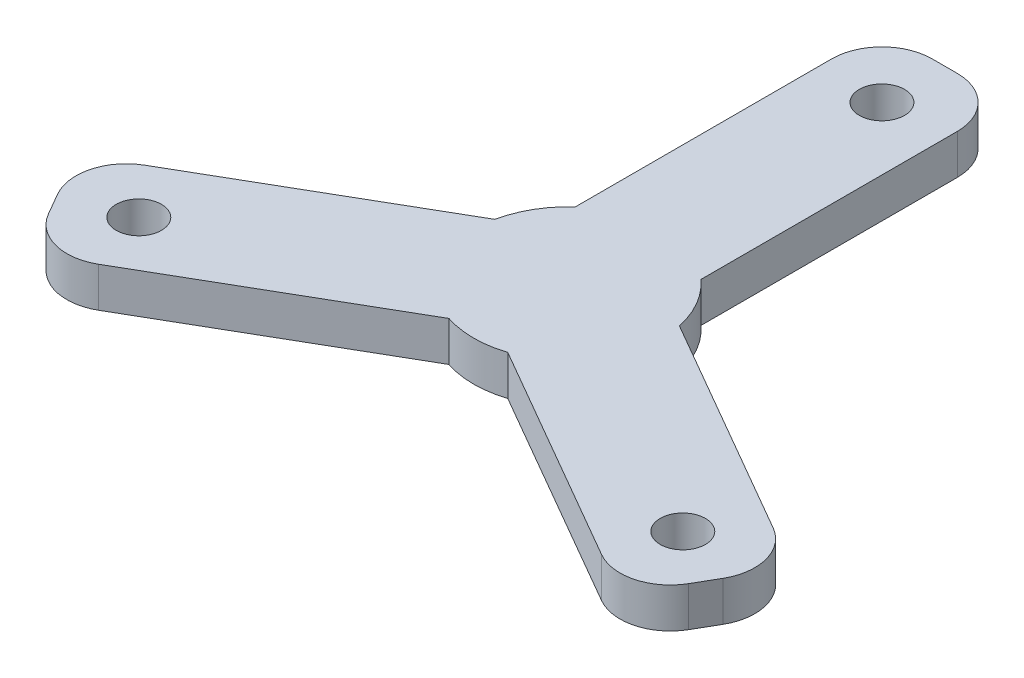
ISO-10303-21;
HEADER;
FILE_DESCRIPTION(('STEP AP214'),'2;1');
FILE_NAME('part.step','',(''),(''),'','','');
FILE_SCHEMA(('AUTOMOTIVE_DESIGN { 1 0 10303 214 1 1 1 1 }'));
ENDSEC;
DATA;
#1=APPLICATION_CONTEXT('core data for automotive mechanical design processes');
#2=APPLICATION_PROTOCOL_DEFINITION('international standard','automotive_design',2000,#1);
#3=PRODUCT_CONTEXT('',#1,'mechanical');
#4=PRODUCT('Part','Part','',(#3));
#5=PRODUCT_RELATED_PRODUCT_CATEGORY('part','',(#4));
#6=PRODUCT_DEFINITION_FORMATION('','',#4);
#7=PRODUCT_DEFINITION_CONTEXT('part definition',#1,'design');
#8=PRODUCT_DEFINITION('design','',#6,#7);
#9=PRODUCT_DEFINITION_SHAPE('','',#8);
#10=(LENGTH_UNIT() NAMED_UNIT(*) SI_UNIT(.MILLI.,.METRE.));
#11=(NAMED_UNIT(*) PLANE_ANGLE_UNIT() SI_UNIT($,.RADIAN.));
#12=(NAMED_UNIT(*) SI_UNIT($,.STERADIAN.) SOLID_ANGLE_UNIT());
#13=UNCERTAINTY_MEASURE_WITH_UNIT(LENGTH_MEASURE(1.E-05),#10,'distance_accuracy_value','');
#14=(GEOMETRIC_REPRESENTATION_CONTEXT(3) GLOBAL_UNCERTAINTY_ASSIGNED_CONTEXT((#13)) GLOBAL_UNIT_ASSIGNED_CONTEXT((#10,
#11,#12)) REPRESENTATION_CONTEXT('',''));
#15=CARTESIAN_POINT('',(0.,0.,0.));
#16=DIRECTION('',(0.,0.,1.));
#17=DIRECTION('',(1.,0.,0.));
#18=AXIS2_PLACEMENT_3D('',#15,#16,#17);
#19=CARTESIAN_POINT('',(0.,3.175,0.));
#20=DIRECTION('',(0.,-1.,0.));
#21=DIRECTION('',(0.,0.,-1.));
#22=AXIS2_PLACEMENT_3D('',#19,#20,#21);
#23=CYLINDRICAL_SURFACE('',#22,7.5);
#24=CARTESIAN_POINT('',(0.,0.,0.));
#25=DIRECTION('',(0.,1.,0.));
#26=DIRECTION('',(0.,0.,1.));
#27=AXIS2_PLACEMENT_3D('',#24,#25,#26);
#28=CIRCLE('',#27,7.5);
#29=CARTESIAN_POINT('',(-5.,0.,-5.59016994374947));
#30=VERTEX_POINT('',#29);
#31=CARTESIAN_POINT('',(-7.34122918275927,0.,-1.53504204704745));
#32=VERTEX_POINT('',#31);
#33=EDGE_CURVE('E219',#30,#32,#28,.T.);
#34=ORIENTED_EDGE('',*,*,#33,.T.);
#35=DIRECTION('',(0.,-1.,0.));
#36=VECTOR('',#35,1.);
#37=CARTESIAN_POINT('',(-7.34122918275927,3.175,-1.53504204704745));
#38=LINE('',#37,#36);
#39=CARTESIAN_POINT('',(-7.34122918275927,3.175,-1.53504204704745));
#40=VERTEX_POINT('',#39);
#41=EDGE_CURVE('E11',#40,#32,#38,.T.);
#42=ORIENTED_EDGE('',*,*,#41,.F.);
#43=CARTESIAN_POINT('',(0.,3.175,0.));
#44=DIRECTION('',(0.,1.,0.));
#45=DIRECTION('',(0.,0.,1.));
#46=AXIS2_PLACEMENT_3D('',#43,#44,#45);
#47=CIRCLE('',#46,7.5);
#48=CARTESIAN_POINT('',(-5.,3.175,-5.59016994374947));
#49=VERTEX_POINT('',#48);
#50=EDGE_CURVE('E297',#49,#40,#47,.T.);
#51=ORIENTED_EDGE('',*,*,#50,.F.);
#52=DIRECTION('',(0.,-1.,0.));
#53=VECTOR('',#52,1.);
#54=CARTESIAN_POINT('',(-5.,3.175,-5.59016994374947));
#55=LINE('',#54,#53);
#56=EDGE_CURVE('E62',#49,#30,#55,.T.);
#57=ORIENTED_EDGE('',*,*,#56,.T.);
#58=EDGE_LOOP('',(#34,#42,#51,#57));
#59=FACE_BOUND('',#58,.T.);
#60=ADVANCED_FACE('F45',(#59),#23,.T.);
#61=CARTESIAN_POINT('',(-2.5,3.175,-4.33012701892219));
#62=DIRECTION('',(0.5,0.,0.866025403784438));
#63=DIRECTION('',(0.866025403784438,0.,-0.5));
#64=AXIS2_PLACEMENT_3D('',#61,#62,#63);
#65=PLANE('',#64);
#66=DIRECTION('',(-0.866025403784438,0.,0.5));
#67=VECTOR('',#66,1.);
#68=CARTESIAN_POINT('',(-2.5,0.,-4.33012701892219));
#69=LINE('',#68,#67);
#70=CARTESIAN_POINT('',(-25.0166604983954,0.,8.66987298107781));
#71=VERTEX_POINT('',#70);
#72=EDGE_CURVE('E222',#32,#71,#69,.T.);
#73=ORIENTED_EDGE('',*,*,#72,.T.);
#74=DIRECTION('',(0.,-1.,0.));
#75=VECTOR('',#74,1.);
#76=CARTESIAN_POINT('',(-25.0166604983954,3.175,8.66987298107781));
#77=LINE('',#76,#75);
#78=CARTESIAN_POINT('',(-25.0166604983954,3.175,8.66987298107781));
#79=VERTEX_POINT('',#78);
#80=EDGE_CURVE('E54',#79,#71,#77,.T.);
#81=ORIENTED_EDGE('',*,*,#80,.F.);
#82=DIRECTION('',(-0.866025403784438,0.,0.5));
#83=VECTOR('',#82,1.);
#84=CARTESIAN_POINT('',(-2.5,3.175,-4.33012701892219));
#85=LINE('',#84,#83);
#86=EDGE_CURVE('E130',#40,#79,#85,.T.);
#87=ORIENTED_EDGE('',*,*,#86,.F.);
#88=ORIENTED_EDGE('',*,*,#41,.T.);
#89=EDGE_LOOP('',(#73,#81,#87,#88));
#90=FACE_BOUND('',#89,.T.);
#91=ADVANCED_FACE('F348',(#90),#65,.F.);
#92=CARTESIAN_POINT('',(-23.0166604983954,3.175,12.1339745962156));
#93=DIRECTION('',(0.,-1.,0.));
#94=DIRECTION('',(0.,0.,-1.));
#95=AXIS2_PLACEMENT_3D('',#92,#93,#94);
#96=CYLINDRICAL_SURFACE('',#95,4.);
#97=CARTESIAN_POINT('',(-23.0166604983954,0.,12.1339745962156));
#98=DIRECTION('',(0.,1.,0.));
#99=DIRECTION('',(0.,0.,1.));
#100=AXIS2_PLACEMENT_3D('',#97,#98,#99);
#101=CIRCLE('',#100,4.);
#102=CARTESIAN_POINT('',(-26.4807621135331,0.,14.1339745962156));
#103=VERTEX_POINT('',#102);
#104=EDGE_CURVE('E226',#103,#71,#101,.F.);
#105=ORIENTED_EDGE('',*,*,#104,.F.);
#106=DIRECTION('',(0.,-1.,0.));
#107=VECTOR('',#106,1.);
#108=CARTESIAN_POINT('',(-26.4807621135331,3.175,14.1339745962156));
#109=LINE('',#108,#107);
#110=CARTESIAN_POINT('',(-26.4807621135331,3.175,14.1339745962156));
#111=VERTEX_POINT('',#110);
#112=EDGE_CURVE('E339',#111,#103,#109,.T.);
#113=ORIENTED_EDGE('',*,*,#112,.F.);
#114=CARTESIAN_POINT('',(-23.0166604983954,3.175,12.1339745962156));
#115=DIRECTION('',(0.,1.,0.));
#116=DIRECTION('',(0.,0.,1.));
#117=AXIS2_PLACEMENT_3D('',#114,#115,#116);
#118=CIRCLE('',#117,4.);
#119=EDGE_CURVE('E347',#111,#79,#118,.F.);
#120=ORIENTED_EDGE('',*,*,#119,.T.);
#121=ORIENTED_EDGE('',*,*,#80,.T.);
#122=EDGE_LOOP('',(#105,#113,#120,#121));
#123=FACE_BOUND('',#122,.T.);
#124=ADVANCED_FACE('F345',(#123),#96,.T.);
#125=CARTESIAN_POINT('',(-25.9807621135332,3.175,15.));
#126=DIRECTION('',(-0.866025403784439,0.,0.5));
#127=DIRECTION('',(0.5,0.,0.866025403784439));
#128=AXIS2_PLACEMENT_3D('',#125,#126,#127);
#129=PLANE('',#128);
#130=DIRECTION('',(-0.5,0.,-0.866025403784439));
#131=VECTOR('',#130,1.);
#132=CARTESIAN_POINT('',(-25.9807621135332,0.,15.));
#133=LINE('',#132,#131);
#134=CARTESIAN_POINT('',(-25.4807621135331,0.,15.8660254037845));
#135=VERTEX_POINT('',#134);
#136=EDGE_CURVE('E230',#135,#103,#133,.T.);
#137=ORIENTED_EDGE('',*,*,#136,.F.);
#138=DIRECTION('',(0.,-1.,0.));
#139=VECTOR('',#138,1.);
#140=CARTESIAN_POINT('',(-25.4807621135331,3.175,15.8660254037845));
#141=LINE('',#140,#139);
#142=CARTESIAN_POINT('',(-25.4807621135331,3.175,15.8660254037845));
#143=VERTEX_POINT('',#142);
#144=EDGE_CURVE('E336',#143,#135,#141,.T.);
#145=ORIENTED_EDGE('',*,*,#144,.F.);
#146=DIRECTION('',(-0.5,0.,-0.866025403784439));
#147=VECTOR('',#146,1.);
#148=CARTESIAN_POINT('',(-25.9807621135332,3.175,15.));
#149=LINE('',#148,#147);
#150=EDGE_CURVE('E359',#143,#111,#149,.T.);
#151=ORIENTED_EDGE('',*,*,#150,.T.);
#152=ORIENTED_EDGE('',*,*,#112,.T.);
#153=EDGE_LOOP('',(#137,#145,#151,#152));
#154=FACE_BOUND('',#153,.T.);
#155=ADVANCED_FACE('F356',(#154),#129,.T.);
#156=CARTESIAN_POINT('',(-22.0166604983954,3.175,13.8660254037844));
#157=DIRECTION('',(0.,-1.,0.));
#158=DIRECTION('',(0.,0.,-1.));
#159=AXIS2_PLACEMENT_3D('',#156,#157,#158);
#160=CYLINDRICAL_SURFACE('',#159,4.);
#161=CARTESIAN_POINT('',(-22.0166604983954,0.,13.8660254037844));
#162=DIRECTION('',(0.,1.,0.));
#163=DIRECTION('',(0.,0.,1.));
#164=AXIS2_PLACEMENT_3D('',#161,#162,#163);
#165=CIRCLE('',#164,4.);
#166=CARTESIAN_POINT('',(-20.0166604983954,0.,17.3301270189222));
#167=VERTEX_POINT('',#166);
#168=EDGE_CURVE('E234',#167,#135,#165,.F.);
#169=ORIENTED_EDGE('',*,*,#168,.F.);
#170=DIRECTION('',(0.,-1.,0.));
#171=VECTOR('',#170,1.);
#172=CARTESIAN_POINT('',(-20.0166604983954,3.175,17.3301270189222));
#173=LINE('',#172,#171);
#174=CARTESIAN_POINT('',(-20.0166604983954,3.175,17.3301270189222));
#175=VERTEX_POINT('',#174);
#176=EDGE_CURVE('E333',#175,#167,#173,.T.);
#177=ORIENTED_EDGE('',*,*,#176,.F.);
#178=CARTESIAN_POINT('',(-22.0166604983954,3.175,13.8660254037844));
#179=DIRECTION('',(0.,1.,0.));
#180=DIRECTION('',(0.,0.,1.));
#181=AXIS2_PLACEMENT_3D('',#178,#179,#180);
#182=CIRCLE('',#181,4.);
#183=EDGE_CURVE('E366',#175,#143,#182,.F.);
#184=ORIENTED_EDGE('',*,*,#183,.T.);
#185=ORIENTED_EDGE('',*,*,#144,.T.);
#186=EDGE_LOOP('',(#169,#177,#184,#185));
#187=FACE_BOUND('',#186,.T.);
#188=ADVANCED_FACE('F437',(#187),#160,.T.);
#189=CARTESIAN_POINT('',(2.5,3.175,4.33012701892219));
#190=DIRECTION('',(0.5,0.,0.866025403784438));
#191=DIRECTION('',(0.866025403784438,0.,-0.500000000000001));
#192=AXIS2_PLACEMENT_3D('',#189,#190,#191);
#193=PLANE('',#192);
#194=DIRECTION('',(-0.866025403784438,0.,0.5));
#195=VECTOR('',#194,1.);
#196=CARTESIAN_POINT('',(2.5,0.,4.33012701892219));
#197=LINE('',#196,#195);
#198=CARTESIAN_POINT('',(-2.34122918275927,0.,7.12521199079693));
#199=VERTEX_POINT('',#198);
#200=EDGE_CURVE('E238',#199,#167,#197,.T.);
#201=ORIENTED_EDGE('',*,*,#200,.F.);
#202=DIRECTION('',(0.,-1.,0.));
#203=VECTOR('',#202,1.);
#204=CARTESIAN_POINT('',(-2.34122918275927,3.175,7.12521199079693));
#205=LINE('',#204,#203);
#206=CARTESIAN_POINT('',(-2.34122918275927,3.175,7.12521199079693));
#207=VERTEX_POINT('',#206);
#208=EDGE_CURVE('E330',#207,#199,#205,.T.);
#209=ORIENTED_EDGE('',*,*,#208,.F.);
#210=DIRECTION('',(-0.866025403784438,0.,0.5));
#211=VECTOR('',#210,1.);
#212=CARTESIAN_POINT('',(2.5,3.175,4.33012701892219));
#213=LINE('',#212,#211);
#214=EDGE_CURVE('E373',#207,#175,#213,.T.);
#215=ORIENTED_EDGE('',*,*,#214,.T.);
#216=ORIENTED_EDGE('',*,*,#176,.T.);
#217=EDGE_LOOP('',(#201,#209,#215,#216));
#218=FACE_BOUND('',#217,.T.);
#219=ADVANCED_FACE('F440',(#218),#193,.T.);
#220=CARTESIAN_POINT('',(0.,3.175,0.));
#221=DIRECTION('',(0.,-1.,0.));
#222=DIRECTION('',(0.,0.,-1.));
#223=AXIS2_PLACEMENT_3D('',#220,#221,#222);
#224=CYLINDRICAL_SURFACE('',#223,7.5);
#225=CARTESIAN_POINT('',(0.,0.,0.));
#226=DIRECTION('',(0.,1.,0.));
#227=DIRECTION('',(0.,0.,1.));
#228=AXIS2_PLACEMENT_3D('',#225,#226,#227);
#229=CIRCLE('',#228,7.5);
#230=CARTESIAN_POINT('',(2.34122918275927,0.,7.12521199079693));
#231=VERTEX_POINT('',#230);
#232=EDGE_CURVE('E242',#199,#231,#229,.T.);
#233=ORIENTED_EDGE('',*,*,#232,.T.);
#234=DIRECTION('',(0.,-1.,0.));
#235=VECTOR('',#234,1.);
#236=CARTESIAN_POINT('',(2.34122918275927,3.175,7.12521199079693));
#237=LINE('',#236,#235);
#238=CARTESIAN_POINT('',(2.34122918275927,3.175,7.12521199079693));
#239=VERTEX_POINT('',#238);
#240=EDGE_CURVE('E326',#239,#231,#237,.T.);
#241=ORIENTED_EDGE('',*,*,#240,.F.);
#242=CARTESIAN_POINT('',(0.,3.175,0.));
#243=DIRECTION('',(0.,1.,0.));
#244=DIRECTION('',(0.,0.,1.));
#245=AXIS2_PLACEMENT_3D('',#242,#243,#244);
#246=CIRCLE('',#245,7.5);
#247=EDGE_CURVE('E377',#207,#239,#246,.T.);
#248=ORIENTED_EDGE('',*,*,#247,.F.);
#249=ORIENTED_EDGE('',*,*,#208,.T.);
#250=EDGE_LOOP('',(#233,#241,#248,#249));
#251=FACE_BOUND('',#250,.T.);
#252=ADVANCED_FACE('F444',(#251),#224,.T.);
#253=CARTESIAN_POINT('',(-2.5,3.175,4.3301270189222));
#254=DIRECTION('',(0.5,0.,-0.866025403784439));
#255=DIRECTION('',(-0.866025403784439,0.,-0.5));
#256=AXIS2_PLACEMENT_3D('',#253,#254,#255);
#257=PLANE('',#256);
#258=DIRECTION('',(0.866025403784439,0.,0.5));
#259=VECTOR('',#258,1.);
#260=CARTESIAN_POINT('',(-2.5,0.,4.3301270189222));
#261=LINE('',#260,#259);
#262=CARTESIAN_POINT('',(20.0166604983954,0.,17.3301270189222));
#263=VERTEX_POINT('',#262);
#264=EDGE_CURVE('E245',#231,#263,#261,.T.);
#265=ORIENTED_EDGE('',*,*,#264,.T.);
#266=DIRECTION('',(0.,-1.,0.));
#267=VECTOR('',#266,1.);
#268=CARTESIAN_POINT('',(20.0166604983954,3.175,17.3301270189222));
#269=LINE('',#268,#267);
#270=CARTESIAN_POINT('',(20.0166604983954,3.175,17.3301270189222));
#271=VERTEX_POINT('',#270);
#272=EDGE_CURVE('E323',#271,#263,#269,.T.);
#273=ORIENTED_EDGE('',*,*,#272,.F.);
#274=DIRECTION('',(0.866025403784439,0.,0.5));
#275=VECTOR('',#274,1.);
#276=CARTESIAN_POINT('',(-2.5,3.175,4.3301270189222));
#277=LINE('',#276,#275);
#278=EDGE_CURVE('E380',#239,#271,#277,.T.);
#279=ORIENTED_EDGE('',*,*,#278,.F.);
#280=ORIENTED_EDGE('',*,*,#240,.T.);
#281=EDGE_LOOP('',(#265,#273,#279,#280));
#282=FACE_BOUND('',#281,.T.);
#283=ADVANCED_FACE('F448',(#282),#257,.F.);
#284=CARTESIAN_POINT('',(22.0166604983954,3.175,13.8660254037844));
#285=DIRECTION('',(0.,-1.,0.));
#286=DIRECTION('',(0.,0.,-1.));
#287=AXIS2_PLACEMENT_3D('',#284,#285,#286);
#288=CYLINDRICAL_SURFACE('',#287,4.);
#289=CARTESIAN_POINT('',(22.0166604983954,0.,13.8660254037844));
#290=DIRECTION('',(0.,1.,0.));
#291=DIRECTION('',(0.,0.,1.));
#292=AXIS2_PLACEMENT_3D('',#289,#290,#291);
#293=CIRCLE('',#292,4.);
#294=CARTESIAN_POINT('',(25.4807621135332,0.,15.8660254037844));
#295=VERTEX_POINT('',#294);
#296=EDGE_CURVE('E249',#295,#263,#293,.F.);
#297=ORIENTED_EDGE('',*,*,#296,.F.);
#298=DIRECTION('',(0.,-1.,0.));
#299=VECTOR('',#298,1.);
#300=CARTESIAN_POINT('',(25.4807621135332,3.175,15.8660254037844));
#301=LINE('',#300,#299);
#302=CARTESIAN_POINT('',(25.4807621135332,3.175,15.8660254037844));
#303=VERTEX_POINT('',#302);
#304=EDGE_CURVE('E320',#303,#295,#301,.T.);
#305=ORIENTED_EDGE('',*,*,#304,.F.);
#306=CARTESIAN_POINT('',(22.0166604983954,3.175,13.8660254037844));
#307=DIRECTION('',(0.,1.,0.));
#308=DIRECTION('',(0.,0.,1.));
#309=AXIS2_PLACEMENT_3D('',#306,#307,#308);
#310=CIRCLE('',#309,4.);
#311=EDGE_CURVE('E383',#303,#271,#310,.F.);
#312=ORIENTED_EDGE('',*,*,#311,.T.);
#313=ORIENTED_EDGE('',*,*,#272,.T.);
#314=EDGE_LOOP('',(#297,#305,#312,#313));
#315=FACE_BOUND('',#314,.T.);
#316=ADVANCED_FACE('F452',(#315),#288,.T.);
#317=CARTESIAN_POINT('',(25.9807621135331,3.175,15.));
#318=DIRECTION('',(0.866025403784438,0.,0.500000000000001));
#319=DIRECTION('',(0.500000000000001,0.,-0.866025403784438));
#320=AXIS2_PLACEMENT_3D('',#317,#318,#319);
#321=PLANE('',#320);
#322=DIRECTION('',(-0.500000000000001,0.,0.866025403784438));
#323=VECTOR('',#322,1.);
#324=CARTESIAN_POINT('',(25.9807621135331,0.,15.));
#325=LINE('',#324,#323);
#326=CARTESIAN_POINT('',(26.4807621135332,0.,14.1339745962156));
#327=VERTEX_POINT('',#326);
#328=EDGE_CURVE('E253',#327,#295,#325,.T.);
#329=ORIENTED_EDGE('',*,*,#328,.F.);
#330=DIRECTION('',(0.,-1.,0.));
#331=VECTOR('',#330,1.);
#332=CARTESIAN_POINT('',(26.4807621135332,3.175,14.1339745962156));
#333=LINE('',#332,#331);
#334=CARTESIAN_POINT('',(26.4807621135332,3.175,14.1339745962156));
#335=VERTEX_POINT('',#334);
#336=EDGE_CURVE('E317',#335,#327,#333,.T.);
#337=ORIENTED_EDGE('',*,*,#336,.F.);
#338=DIRECTION('',(-0.500000000000001,0.,0.866025403784438));
#339=VECTOR('',#338,1.);
#340=CARTESIAN_POINT('',(25.9807621135331,3.175,15.));
#341=LINE('',#340,#339);
#342=EDGE_CURVE('E387',#335,#303,#341,.T.);
#343=ORIENTED_EDGE('',*,*,#342,.T.);
#344=ORIENTED_EDGE('',*,*,#304,.T.);
#345=EDGE_LOOP('',(#329,#337,#343,#344));
#346=FACE_BOUND('',#345,.T.);
#347=ADVANCED_FACE('F456',(#346),#321,.T.);
#348=CARTESIAN_POINT('',(23.0166604983954,3.175,12.1339745962156));
#349=DIRECTION('',(0.,-1.,0.));
#350=DIRECTION('',(0.,0.,-1.));
#351=AXIS2_PLACEMENT_3D('',#348,#349,#350);
#352=CYLINDRICAL_SURFACE('',#351,4.);
#353=CARTESIAN_POINT('',(23.0166604983954,0.,12.1339745962156));
#354=DIRECTION('',(0.,1.,0.));
#355=DIRECTION('',(0.,0.,1.));
#356=AXIS2_PLACEMENT_3D('',#353,#354,#355);
#357=CIRCLE('',#356,4.);
#358=CARTESIAN_POINT('',(25.0166604983954,0.,8.6698729810778));
#359=VERTEX_POINT('',#358);
#360=EDGE_CURVE('E257',#359,#327,#357,.F.);
#361=ORIENTED_EDGE('',*,*,#360,.F.);
#362=DIRECTION('',(0.,-1.,0.));
#363=VECTOR('',#362,1.);
#364=CARTESIAN_POINT('',(25.0166604983954,3.175,8.6698729810778));
#365=LINE('',#364,#363);
#366=CARTESIAN_POINT('',(25.0166604983954,3.175,8.6698729810778));
#367=VERTEX_POINT('',#366);
#368=EDGE_CURVE('E314',#367,#359,#365,.T.);
#369=ORIENTED_EDGE('',*,*,#368,.F.);
#370=CARTESIAN_POINT('',(23.0166604983954,3.175,12.1339745962156));
#371=DIRECTION('',(0.,1.,0.));
#372=DIRECTION('',(0.,0.,1.));
#373=AXIS2_PLACEMENT_3D('',#370,#371,#372);
#374=CIRCLE('',#373,4.);
#375=EDGE_CURVE('E391',#367,#335,#374,.F.);
#376=ORIENTED_EDGE('',*,*,#375,.T.);
#377=ORIENTED_EDGE('',*,*,#336,.T.);
#378=EDGE_LOOP('',(#361,#369,#376,#377));
#379=FACE_BOUND('',#378,.T.);
#380=ADVANCED_FACE('F460',(#379),#352,.T.);
#381=CARTESIAN_POINT('',(2.5,3.175,-4.3301270189222));
#382=DIRECTION('',(0.5,0.,-0.866025403784439));
#383=DIRECTION('',(-0.866025403784439,0.,-0.5));
#384=AXIS2_PLACEMENT_3D('',#381,#382,#383);
#385=PLANE('',#384);
#386=DIRECTION('',(0.866025403784439,0.,0.5));
#387=VECTOR('',#386,1.);
#388=CARTESIAN_POINT('',(2.5,0.,-4.3301270189222));
#389=LINE('',#388,#387);
#390=CARTESIAN_POINT('',(7.34122918275927,0.,-1.53504204704746));
#391=VERTEX_POINT('',#390);
#392=EDGE_CURVE('E261',#391,#359,#389,.T.);
#393=ORIENTED_EDGE('',*,*,#392,.F.);
#394=DIRECTION('',(0.,-1.,0.));
#395=VECTOR('',#394,1.);
#396=CARTESIAN_POINT('',(7.34122918275927,3.175,-1.53504204704746));
#397=LINE('',#396,#395);
#398=CARTESIAN_POINT('',(7.34122918275927,3.175,-1.53504204704746));
#399=VERTEX_POINT('',#398);
#400=EDGE_CURVE('E311',#399,#391,#397,.T.);
#401=ORIENTED_EDGE('',*,*,#400,.F.);
#402=DIRECTION('',(0.866025403784439,0.,0.5));
#403=VECTOR('',#402,1.);
#404=CARTESIAN_POINT('',(2.5,3.175,-4.3301270189222));
#405=LINE('',#404,#403);
#406=EDGE_CURVE('E395',#399,#367,#405,.T.);
#407=ORIENTED_EDGE('',*,*,#406,.T.);
#408=ORIENTED_EDGE('',*,*,#368,.T.);
#409=EDGE_LOOP('',(#393,#401,#407,#408));
#410=FACE_BOUND('',#409,.T.);
#411=ADVANCED_FACE('F464',(#410),#385,.T.);
#412=CARTESIAN_POINT('',(0.,3.175,0.));
#413=DIRECTION('',(0.,-1.,0.));
#414=DIRECTION('',(0.,0.,-1.));
#415=AXIS2_PLACEMENT_3D('',#412,#413,#414);
#416=CYLINDRICAL_SURFACE('',#415,7.5);
#417=CARTESIAN_POINT('',(0.,0.,0.));
#418=DIRECTION('',(0.,1.,0.));
#419=DIRECTION('',(0.,0.,1.));
#420=AXIS2_PLACEMENT_3D('',#417,#418,#419);
#421=CIRCLE('',#420,7.5);
#422=CARTESIAN_POINT('',(5.,0.,-5.59016994374947));
#423=VERTEX_POINT('',#422);
#424=EDGE_CURVE('E265',#391,#423,#421,.T.);
#425=ORIENTED_EDGE('',*,*,#424,.T.);
#426=DIRECTION('',(0.,-1.,0.));
#427=VECTOR('',#426,1.);
#428=CARTESIAN_POINT('',(5.,3.175,-5.59016994374947));
#429=LINE('',#428,#427);
#430=CARTESIAN_POINT('',(5.,3.175,-5.59016994374947));
#431=VERTEX_POINT('',#430);
#432=EDGE_CURVE('E307',#431,#423,#429,.T.);
#433=ORIENTED_EDGE('',*,*,#432,.F.);
#434=CARTESIAN_POINT('',(0.,3.175,0.));
#435=DIRECTION('',(0.,1.,0.));
#436=DIRECTION('',(0.,0.,1.));
#437=AXIS2_PLACEMENT_3D('',#434,#435,#436);
#438=CIRCLE('',#437,7.5);
#439=EDGE_CURVE('E399',#399,#431,#438,.T.);
#440=ORIENTED_EDGE('',*,*,#439,.F.);
#441=ORIENTED_EDGE('',*,*,#400,.T.);
#442=EDGE_LOOP('',(#425,#433,#440,#441));
#443=FACE_BOUND('',#442,.T.);
#444=ADVANCED_FACE('F468',(#443),#416,.T.);
#445=CARTESIAN_POINT('',(5.,3.175,0.));
#446=DIRECTION('',(-1.,0.,0.));
#447=DIRECTION('',(0.,0.,1.));
#448=AXIS2_PLACEMENT_3D('',#445,#446,#447);
#449=PLANE('',#448);
#450=DIRECTION('',(0.,0.,-1.));
#451=VECTOR('',#450,1.);
#452=CARTESIAN_POINT('',(5.,0.,0.));
#453=LINE('',#452,#451);
#454=CARTESIAN_POINT('',(5.,0.,-26.));
#455=VERTEX_POINT('',#454);
#456=EDGE_CURVE('E268',#423,#455,#453,.T.);
#457=ORIENTED_EDGE('',*,*,#456,.T.);
#458=DIRECTION('',(0.,-1.,0.));
#459=VECTOR('',#458,1.);
#460=CARTESIAN_POINT('',(5.,3.175,-26.));
#461=LINE('',#460,#459);
#462=CARTESIAN_POINT('',(5.,3.175,-26.));
#463=VERTEX_POINT('',#462);
#464=EDGE_CURVE('E304',#463,#455,#461,.T.);
#465=ORIENTED_EDGE('',*,*,#464,.F.);
#466=DIRECTION('',(0.,0.,-1.));
#467=VECTOR('',#466,1.);
#468=CARTESIAN_POINT('',(5.,3.175,0.));
#469=LINE('',#468,#467);
#470=EDGE_CURVE('E402',#431,#463,#469,.T.);
#471=ORIENTED_EDGE('',*,*,#470,.F.);
#472=ORIENTED_EDGE('',*,*,#432,.T.);
#473=EDGE_LOOP('',(#457,#465,#471,#472));
#474=FACE_BOUND('',#473,.T.);
#475=ADVANCED_FACE('F472',(#474),#449,.F.);
#476=CARTESIAN_POINT('',(1.,3.175,-26.));
#477=DIRECTION('',(0.,-1.,0.));
#478=DIRECTION('',(0.,0.,-1.));
#479=AXIS2_PLACEMENT_3D('',#476,#477,#478);
#480=CYLINDRICAL_SURFACE('',#479,4.);
#481=CARTESIAN_POINT('',(1.,0.,-26.));
#482=DIRECTION('',(0.,1.,0.));
#483=DIRECTION('',(0.,0.,1.));
#484=AXIS2_PLACEMENT_3D('',#481,#482,#483);
#485=CIRCLE('',#484,4.);
#486=CARTESIAN_POINT('',(1.,0.,-30.));
#487=VERTEX_POINT('',#486);
#488=EDGE_CURVE('E272',#487,#455,#485,.F.);
#489=ORIENTED_EDGE('',*,*,#488,.F.);
#490=DIRECTION('',(0.,-1.,0.));
#491=VECTOR('',#490,1.);
#492=CARTESIAN_POINT('',(1.,3.175,-30.));
#493=LINE('',#492,#491);
#494=CARTESIAN_POINT('',(1.,3.175,-30.));
#495=VERTEX_POINT('',#494);
#496=EDGE_CURVE('E186',#495,#487,#493,.T.);
#497=ORIENTED_EDGE('',*,*,#496,.F.);
#498=CARTESIAN_POINT('',(1.,3.175,-26.));
#499=DIRECTION('',(0.,1.,0.));
#500=DIRECTION('',(0.,0.,1.));
#501=AXIS2_PLACEMENT_3D('',#498,#499,#500);
#502=CIRCLE('',#501,4.);
#503=EDGE_CURVE('E196',#495,#463,#502,.F.);
#504=ORIENTED_EDGE('',*,*,#503,.T.);
#505=ORIENTED_EDGE('',*,*,#464,.T.);
#506=EDGE_LOOP('',(#489,#497,#504,#505));
#507=FACE_BOUND('',#506,.T.);
#508=ADVANCED_FACE('F407',(#507),#480,.T.);
#509=CARTESIAN_POINT('',(0.,3.175,-30.));
#510=DIRECTION('',(0.,0.,-1.));
#511=DIRECTION('',(-1.,0.,0.));
#512=AXIS2_PLACEMENT_3D('',#509,#510,#511);
#513=PLANE('',#512);
#514=DIRECTION('',(1.,0.,0.));
#515=VECTOR('',#514,1.);
#516=CARTESIAN_POINT('',(0.,0.,-30.));
#517=LINE('',#516,#515);
#518=CARTESIAN_POINT('',(-1.,0.,-30.));
#519=VERTEX_POINT('',#518);
#520=EDGE_CURVE('E181',#519,#487,#517,.T.);
#521=ORIENTED_EDGE('',*,*,#520,.F.);
#522=DIRECTION('',(0.,-1.,0.));
#523=VECTOR('',#522,1.);
#524=CARTESIAN_POINT('',(-1.,3.175,-30.));
#525=LINE('',#524,#523);
#526=CARTESIAN_POINT('',(-1.,3.175,-30.));
#527=VERTEX_POINT('',#526);
#528=EDGE_CURVE('E176',#527,#519,#525,.T.);
#529=ORIENTED_EDGE('',*,*,#528,.F.);
#530=DIRECTION('',(1.,0.,0.));
#531=VECTOR('',#530,1.);
#532=CARTESIAN_POINT('',(0.,3.175,-30.));
#533=LINE('',#532,#531);
#534=EDGE_CURVE('E179',#527,#495,#533,.T.);
#535=ORIENTED_EDGE('',*,*,#534,.T.);
#536=ORIENTED_EDGE('',*,*,#496,.T.);
#537=EDGE_LOOP('',(#521,#529,#535,#536));
#538=FACE_BOUND('',#537,.T.);
#539=ADVANCED_FACE('F178',(#538),#513,.T.);
#540=CARTESIAN_POINT('',(-1.,3.175,-26.));
#541=DIRECTION('',(0.,-1.,0.));
#542=DIRECTION('',(0.,0.,-1.));
#543=AXIS2_PLACEMENT_3D('',#540,#541,#542);
#544=CYLINDRICAL_SURFACE('',#543,4.);
#545=CARTESIAN_POINT('',(-1.,0.,-26.));
#546=DIRECTION('',(0.,1.,0.));
#547=DIRECTION('',(0.,0.,1.));
#548=AXIS2_PLACEMENT_3D('',#545,#546,#547);
#549=CIRCLE('',#548,4.);
#550=CARTESIAN_POINT('',(-5.,0.,-26.));
#551=VERTEX_POINT('',#550);
#552=EDGE_CURVE('E278',#551,#519,#549,.F.);
#553=ORIENTED_EDGE('',*,*,#552,.F.);
#554=DIRECTION('',(0.,-1.,0.));
#555=VECTOR('',#554,1.);
#556=CARTESIAN_POINT('',(-5.,3.175,-26.));
#557=LINE('',#556,#555);
#558=CARTESIAN_POINT('',(-5.,3.175,-26.));
#559=VERTEX_POINT('',#558);
#560=EDGE_CURVE('E118',#559,#551,#557,.T.);
#561=ORIENTED_EDGE('',*,*,#560,.F.);
#562=CARTESIAN_POINT('',(-1.,3.175,-26.));
#563=DIRECTION('',(0.,1.,0.));
#564=DIRECTION('',(0.,0.,1.));
#565=AXIS2_PLACEMENT_3D('',#562,#563,#564);
#566=CIRCLE('',#565,4.);
#567=EDGE_CURVE('E194',#559,#527,#566,.F.);
#568=ORIENTED_EDGE('',*,*,#567,.T.);
#569=ORIENTED_EDGE('',*,*,#528,.T.);
#570=EDGE_LOOP('',(#553,#561,#568,#569));
#571=FACE_BOUND('',#570,.T.);
#572=ADVANCED_FACE('F199',(#571),#544,.T.);
#573=CARTESIAN_POINT('',(21.650635094611,3.175,12.5));
#574=DIRECTION('',(0.,-1.,0.));
#575=DIRECTION('',(0.,0.,-1.));
#576=AXIS2_PLACEMENT_3D('',#573,#574,#575);
#577=CYLINDRICAL_SURFACE('',#576,1.8);
#578=CARTESIAN_POINT('',(21.650635094611,3.175,12.5));
#579=DIRECTION('',(0.,1.,0.));
#580=DIRECTION('',(0.,0.,1.));
#581=AXIS2_PLACEMENT_3D('',#578,#579,#580);
#582=CIRCLE('',#581,1.8);
#583=CARTESIAN_POINT('',(21.650635094611,3.175,14.3));
#584=VERTEX_POINT('',#583);
#585=EDGE_CURVE('E211',#584,#584,#582,.T.);
#586=ORIENTED_EDGE('',*,*,#585,.T.);
#587=EDGE_LOOP('',(#586));
#588=FACE_BOUND('',#587,.T.);
#589=CARTESIAN_POINT('',(21.650635094611,0.,12.5));
#590=DIRECTION('',(0.,1.,0.));
#591=DIRECTION('',(0.,0.,1.));
#592=AXIS2_PLACEMENT_3D('',#589,#590,#591);
#593=CIRCLE('',#592,1.8);
#594=CARTESIAN_POINT('',(21.650635094611,0.,14.3));
#595=VERTEX_POINT('',#594);
#596=EDGE_CURVE('E289',#595,#595,#593,.T.);
#597=ORIENTED_EDGE('',*,*,#596,.F.);
#598=EDGE_LOOP('',(#597));
#599=FACE_BOUND('',#598,.T.);
#600=ADVANCED_FACE('F421',(#588,#599),#577,.F.);
#601=CARTESIAN_POINT('',(0.,3.175,-25.));
#602=DIRECTION('',(0.,-1.,0.));
#603=DIRECTION('',(0.,0.,-1.));
#604=AXIS2_PLACEMENT_3D('',#601,#602,#603);
#605=CYLINDRICAL_SURFACE('',#604,1.8);
#606=CARTESIAN_POINT('',(0.,3.175,-25.));
#607=DIRECTION('',(0.,1.,0.));
#608=DIRECTION('',(0.,0.,1.));
#609=AXIS2_PLACEMENT_3D('',#606,#607,#608);
#610=CIRCLE('',#609,1.8);
#611=CARTESIAN_POINT('',(0.,3.175,-23.2));
#612=VERTEX_POINT('',#611);
#613=EDGE_CURVE('E204',#612,#612,#610,.T.);
#614=ORIENTED_EDGE('',*,*,#613,.T.);
#615=EDGE_LOOP('',(#614));
#616=FACE_BOUND('',#615,.T.);
#617=CARTESIAN_POINT('',(0.,0.,-25.));
#618=DIRECTION('',(0.,1.,0.));
#619=DIRECTION('',(0.,0.,1.));
#620=AXIS2_PLACEMENT_3D('',#617,#618,#619);
#621=CIRCLE('',#620,1.8);
#622=CARTESIAN_POINT('',(0.,0.,-23.2));
#623=VERTEX_POINT('',#622);
#624=EDGE_CURVE('E285',#623,#623,#621,.T.);
#625=ORIENTED_EDGE('',*,*,#624,.F.);
#626=EDGE_LOOP('',(#625));
#627=FACE_BOUND('',#626,.T.);
#628=ADVANCED_FACE('F413',(#616,#627),#605,.F.);
#629=CARTESIAN_POINT('',(-5.,3.175,0.));
#630=DIRECTION('',(-1.,0.,0.));
#631=DIRECTION('',(0.,0.,1.));
#632=AXIS2_PLACEMENT_3D('',#629,#630,#631);
#633=PLANE('',#632);
#634=DIRECTION('',(0.,0.,-1.));
#635=VECTOR('',#634,1.);
#636=CARTESIAN_POINT('',(-5.,0.,0.));
#637=LINE('',#636,#635);
#638=EDGE_CURVE('E281',#30,#551,#637,.T.);
#639=ORIENTED_EDGE('',*,*,#638,.F.);
#640=ORIENTED_EDGE('',*,*,#56,.F.);
#641=DIRECTION('',(0.,0.,-1.));
#642=VECTOR('',#641,1.);
#643=CARTESIAN_POINT('',(-5.,3.175,0.));
#644=LINE('',#643,#642);
#645=EDGE_CURVE('E201',#49,#559,#644,.T.);
#646=ORIENTED_EDGE('',*,*,#645,.T.);
#647=ORIENTED_EDGE('',*,*,#560,.T.);
#648=EDGE_LOOP('',(#639,#640,#646,#647));
#649=FACE_BOUND('',#648,.T.);
#650=ADVANCED_FACE('F410',(#649),#633,.T.);
#651=CARTESIAN_POINT('',(-21.650635094611,3.175,12.5));
#652=DIRECTION('',(0.,-1.,0.));
#653=DIRECTION('',(0.,0.,-1.));
#654=AXIS2_PLACEMENT_3D('',#651,#652,#653);
#655=CYLINDRICAL_SURFACE('',#654,1.8);
#656=CARTESIAN_POINT('',(-21.650635094611,3.175,12.5));
#657=DIRECTION('',(0.,1.,0.));
#658=DIRECTION('',(0.,0.,1.));
#659=AXIS2_PLACEMENT_3D('',#656,#657,#658);
#660=CIRCLE('',#659,1.8);
#661=CARTESIAN_POINT('',(-21.650635094611,3.175,14.3));
#662=VERTEX_POINT('',#661);
#663=EDGE_CURVE('E215',#662,#662,#660,.T.);
#664=ORIENTED_EDGE('',*,*,#663,.T.);
#665=EDGE_LOOP('',(#664));
#666=FACE_BOUND('',#665,.T.);
#667=CARTESIAN_POINT('',(-21.650635094611,0.,12.5));
#668=DIRECTION('',(0.,1.,0.));
#669=DIRECTION('',(0.,0.,1.));
#670=AXIS2_PLACEMENT_3D('',#667,#668,#669);
#671=CIRCLE('',#670,1.8);
#672=CARTESIAN_POINT('',(-21.650635094611,0.,14.3));
#673=VERTEX_POINT('',#672);
#674=EDGE_CURVE('E293',#673,#673,#671,.T.);
#675=ORIENTED_EDGE('',*,*,#674,.F.);
#676=EDGE_LOOP('',(#675));
#677=FACE_BOUND('',#676,.T.);
#678=ADVANCED_FACE('F412',(#666,#677),#655,.F.);
#679=CARTESIAN_POINT('',(0.,3.175,0.));
#680=DIRECTION('',(0.,1.,0.));
#681=DIRECTION('',(0.,0.,1.));
#682=AXIS2_PLACEMENT_3D('',#679,#680,#681);
#683=PLANE('',#682);
#684=ORIENTED_EDGE('',*,*,#50,.T.);
#685=ORIENTED_EDGE('',*,*,#86,.T.);
#686=ORIENTED_EDGE('',*,*,#119,.F.);
#687=ORIENTED_EDGE('',*,*,#150,.F.);
#688=ORIENTED_EDGE('',*,*,#183,.F.);
#689=ORIENTED_EDGE('',*,*,#214,.F.);
#690=ORIENTED_EDGE('',*,*,#247,.T.);
#691=ORIENTED_EDGE('',*,*,#278,.T.);
#692=ORIENTED_EDGE('',*,*,#311,.F.);
#693=ORIENTED_EDGE('',*,*,#342,.F.);
#694=ORIENTED_EDGE('',*,*,#375,.F.);
#695=ORIENTED_EDGE('',*,*,#406,.F.);
#696=ORIENTED_EDGE('',*,*,#439,.T.);
#697=ORIENTED_EDGE('',*,*,#470,.T.);
#698=ORIENTED_EDGE('',*,*,#503,.F.);
#699=ORIENTED_EDGE('',*,*,#534,.F.);
#700=ORIENTED_EDGE('',*,*,#567,.F.);
#701=ORIENTED_EDGE('',*,*,#645,.F.);
#702=EDGE_LOOP('',(#684,#685,#686,#687,#688,#689,#690,#691,#692,#693,#694,#695,#696,#697,#698,
#699,#700,#701));
#703=FACE_BOUND('',#702,.T.);
#704=ORIENTED_EDGE('',*,*,#613,.F.);
#705=EDGE_LOOP('',(#704));
#706=FACE_BOUND('',#705,.T.);
#707=ORIENTED_EDGE('',*,*,#585,.F.);
#708=EDGE_LOOP('',(#707));
#709=FACE_BOUND('',#708,.T.);
#710=ORIENTED_EDGE('',*,*,#663,.F.);
#711=EDGE_LOOP('',(#710));
#712=FACE_BOUND('',#711,.T.);
#713=ADVANCED_FACE('F191',(#703,#706,#709,#712),#683,.T.);
#714=CARTESIAN_POINT('',(0.,0.,0.));
#715=DIRECTION('',(0.,1.,0.));
#716=DIRECTION('',(0.,0.,1.));
#717=AXIS2_PLACEMENT_3D('',#714,#715,#716);
#718=PLANE('',#717);
#719=ORIENTED_EDGE('',*,*,#33,.F.);
#720=ORIENTED_EDGE('',*,*,#638,.T.);
#721=ORIENTED_EDGE('',*,*,#552,.T.);
#722=ORIENTED_EDGE('',*,*,#520,.T.);
#723=ORIENTED_EDGE('',*,*,#488,.T.);
#724=ORIENTED_EDGE('',*,*,#456,.F.);
#725=ORIENTED_EDGE('',*,*,#424,.F.);
#726=ORIENTED_EDGE('',*,*,#392,.T.);
#727=ORIENTED_EDGE('',*,*,#360,.T.);
#728=ORIENTED_EDGE('',*,*,#328,.T.);
#729=ORIENTED_EDGE('',*,*,#296,.T.);
#730=ORIENTED_EDGE('',*,*,#264,.F.);
#731=ORIENTED_EDGE('',*,*,#232,.F.);
#732=ORIENTED_EDGE('',*,*,#200,.T.);
#733=ORIENTED_EDGE('',*,*,#168,.T.);
#734=ORIENTED_EDGE('',*,*,#136,.T.);
#735=ORIENTED_EDGE('',*,*,#104,.T.);
#736=ORIENTED_EDGE('',*,*,#72,.F.);
#737=EDGE_LOOP('',(#719,#720,#721,#722,#723,#724,#725,#726,#727,#728,#729,#730,#731,#732,#733,
#734,#735,#736));
#738=FACE_BOUND('',#737,.T.);
#739=ORIENTED_EDGE('',*,*,#624,.T.);
#740=EDGE_LOOP('',(#739));
#741=FACE_BOUND('',#740,.T.);
#742=ORIENTED_EDGE('',*,*,#596,.T.);
#743=EDGE_LOOP('',(#742));
#744=FACE_BOUND('',#743,.T.);
#745=ORIENTED_EDGE('',*,*,#674,.T.);
#746=EDGE_LOOP('',(#745));
#747=FACE_BOUND('',#746,.T.);
#748=ADVANCED_FACE('F351',(#738,#741,#744,#747),#718,.F.);
#749=CLOSED_SHELL('',(#60,#91,#124,#155,#188,#219,#252,#283,#316,#347,#380,#411,#444,#475,#508,
#539,#572,#600,#628,#650,#678,#713,#748));
#750=MANIFOLD_SOLID_BREP('B2',#749);
#751=ADVANCED_BREP_SHAPE_REPRESENTATION('',(#18,#750),#14);
#752=SHAPE_DEFINITION_REPRESENTATION(#9,#751);
ENDSEC;
END-ISO-10303-21;
